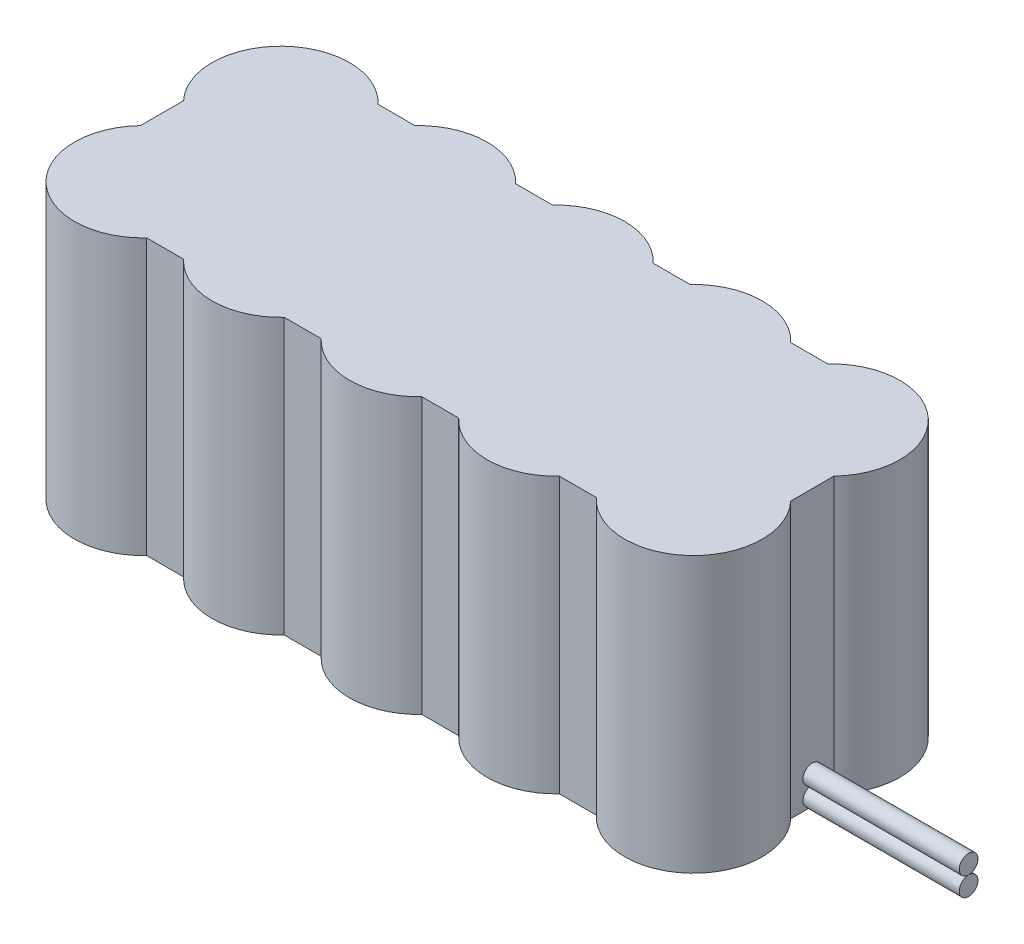
ISO-10303-21;
HEADER;
FILE_DESCRIPTION(('STEP AP214'),'2;1');
FILE_NAME('part.step','',(''),(''),'','','');
FILE_SCHEMA(('AUTOMOTIVE_DESIGN { 1 0 10303 214 1 1 1 1 }'));
ENDSEC;
DATA;
#1=APPLICATION_CONTEXT('core data for automotive mechanical design processes');
#2=APPLICATION_PROTOCOL_DEFINITION('international standard','automotive_design',2000,#1);
#3=PRODUCT_CONTEXT('',#1,'mechanical');
#4=PRODUCT('Part','Part','',(#3));
#5=PRODUCT_RELATED_PRODUCT_CATEGORY('part','',(#4));
#6=PRODUCT_DEFINITION_FORMATION('','',#4);
#7=PRODUCT_DEFINITION_CONTEXT('part definition',#1,'design');
#8=PRODUCT_DEFINITION('design','',#6,#7);
#9=PRODUCT_DEFINITION_SHAPE('','',#8);
#10=(LENGTH_UNIT() NAMED_UNIT(*) SI_UNIT(.MILLI.,.METRE.));
#11=(NAMED_UNIT(*) PLANE_ANGLE_UNIT() SI_UNIT($,.RADIAN.));
#12=(NAMED_UNIT(*) SI_UNIT($,.STERADIAN.) SOLID_ANGLE_UNIT());
#13=UNCERTAINTY_MEASURE_WITH_UNIT(LENGTH_MEASURE(1.E-05),#10,'distance_accuracy_value','');
#14=(GEOMETRIC_REPRESENTATION_CONTEXT(3) GLOBAL_UNCERTAINTY_ASSIGNED_CONTEXT((#13)) GLOBAL_UNIT_ASSIGNED_CONTEXT((#10,
#11,#12)) REPRESENTATION_CONTEXT('',''));
#15=CARTESIAN_POINT('',(0.,0.,0.));
#16=DIRECTION('',(0.,0.,1.));
#17=DIRECTION('',(1.,0.,0.));
#18=AXIS2_PLACEMENT_3D('',#15,#16,#17);
#19=CARTESIAN_POINT('',(96.,4.5,0.));
#20=DIRECTION('',(1.,0.,0.));
#21=DIRECTION('',(0.,0.,-1.));
#22=AXIS2_PLACEMENT_3D('',#19,#20,#21);
#23=CYLINDRICAL_SURFACE('',#22,1.5);
#24=CARTESIAN_POINT('',(121.,4.5,0.));
#25=DIRECTION('',(1.,0.,0.));
#26=DIRECTION('',(0.,0.,-1.));
#27=AXIS2_PLACEMENT_3D('',#24,#25,#26);
#28=CIRCLE('',#27,1.5);
#29=CARTESIAN_POINT('',(121.,4.5,-1.5));
#30=VERTEX_POINT('',#29);
#31=EDGE_CURVE('E109',#30,#30,#28,.F.);
#32=ORIENTED_EDGE('',*,*,#31,.T.);
#33=EDGE_LOOP('',(#32));
#34=FACE_BOUND('',#33,.T.);
#35=CARTESIAN_POINT('',(96.,4.5,0.));
#36=DIRECTION('',(1.,0.,0.));
#37=DIRECTION('',(0.,0.,-1.));
#38=AXIS2_PLACEMENT_3D('',#35,#36,#37);
#39=CIRCLE('',#38,1.5);
#40=CARTESIAN_POINT('',(96.,3.,0.));
#41=VERTEX_POINT('',#40);
#42=EDGE_CURVE('E47',#41,#41,#39,.T.);
#43=ORIENTED_EDGE('',*,*,#42,.T.);
#44=EDGE_LOOP('',(#43));
#45=FACE_BOUND('',#44,.T.);
#46=ADVANCED_FACE('F16',(#34,#45),#23,.T.);
#47=CARTESIAN_POINT('',(121.,0.,0.));
#48=DIRECTION('',(1.,0.,0.));
#49=DIRECTION('',(0.,0.,-1.));
#50=AXIS2_PLACEMENT_3D('',#47,#48,#49);
#51=PLANE('',#50);
#52=ORIENTED_EDGE('',*,*,#31,.F.);
#53=EDGE_LOOP('',(#52));
#54=FACE_BOUND('',#53,.T.);
#55=ADVANCED_FACE('F18',(#54),#51,.T.);
#56=CARTESIAN_POINT('',(96.,1.5,0.));
#57=DIRECTION('',(1.,0.,0.));
#58=DIRECTION('',(0.,0.,-1.));
#59=AXIS2_PLACEMENT_3D('',#56,#57,#58);
#60=CYLINDRICAL_SURFACE('',#59,1.5);
#61=CARTESIAN_POINT('',(121.,1.5,0.));
#62=DIRECTION('',(1.,0.,0.));
#63=DIRECTION('',(0.,0.,-1.));
#64=AXIS2_PLACEMENT_3D('',#61,#62,#63);
#65=CIRCLE('',#64,1.5);
#66=CARTESIAN_POINT('',(121.,1.5,-1.5));
#67=VERTEX_POINT('',#66);
#68=EDGE_CURVE('E106',#67,#67,#65,.F.);
#69=ORIENTED_EDGE('',*,*,#68,.T.);
#70=EDGE_LOOP('',(#69));
#71=FACE_BOUND('',#70,.T.);
#72=CARTESIAN_POINT('',(96.,1.5,0.));
#73=DIRECTION('',(1.,0.,0.));
#74=DIRECTION('',(0.,0.,-1.));
#75=AXIS2_PLACEMENT_3D('',#72,#73,#74);
#76=CIRCLE('',#75,1.5);
#77=CARTESIAN_POINT('',(96.,0.,0.));
#78=VERTEX_POINT('',#77);
#79=EDGE_CURVE('E53',#41,#78,#76,.T.);
#80=ORIENTED_EDGE('',*,*,#79,.T.);
#81=CARTESIAN_POINT('',(96.,1.5,0.));
#82=DIRECTION('',(1.,0.,0.));
#83=DIRECTION('',(0.,0.,-1.));
#84=AXIS2_PLACEMENT_3D('',#81,#82,#83);
#85=CIRCLE('',#84,1.5);
#86=EDGE_CURVE('E57',#78,#41,#85,.T.);
#87=ORIENTED_EDGE('',*,*,#86,.T.);
#88=EDGE_LOOP('',(#80,#87));
#89=FACE_BOUND('',#88,.T.);
#90=ADVANCED_FACE('F55',(#71,#89),#60,.T.);
#91=CARTESIAN_POINT('',(121.,0.,0.));
#92=DIRECTION('',(1.,0.,0.));
#93=DIRECTION('',(0.,0.,-1.));
#94=AXIS2_PLACEMENT_3D('',#91,#92,#93);
#95=PLANE('',#94);
#96=ORIENTED_EDGE('',*,*,#68,.F.);
#97=EDGE_LOOP('',(#96));
#98=FACE_BOUND('',#97,.T.);
#99=ADVANCED_FACE('F120',(#98),#95,.T.);
#100=CARTESIAN_POINT('',(0.,0.,0.));
#101=DIRECTION('',(0.,1.,0.));
#102=DIRECTION('',(0.,0.,1.));
#103=AXIS2_PLACEMENT_3D('',#100,#101,#102);
#104=PLANE('',#103);
#105=DIRECTION('',(1.,0.,0.));
#106=VECTOR('',#105,1.);
#107=CARTESIAN_POINT('',(0.,0.,18.5));
#108=LINE('',#107,#106);
#109=CARTESIAN_POINT('',(74.0467384697155,0.,18.5));
#110=VERTEX_POINT('',#109);
#111=CARTESIAN_POINT('',(79.9532615302845,0.,18.5));
#112=VERTEX_POINT('',#111);
#113=EDGE_CURVE('E108',#110,#112,#108,.T.);
#114=ORIENTED_EDGE('',*,*,#113,.F.);
#115=CARTESIAN_POINT('',(66.,0.,11.));
#116=DIRECTION('',(0.,1.,0.));
#117=DIRECTION('',(0.,0.,1.));
#118=AXIS2_PLACEMENT_3D('',#115,#116,#117);
#119=CIRCLE('',#118,11.);
#120=CARTESIAN_POINT('',(57.9532615302845,0.,18.5));
#121=VERTEX_POINT('',#120);
#122=EDGE_CURVE('E522',#121,#110,#119,.T.);
#123=ORIENTED_EDGE('',*,*,#122,.F.);
#124=DIRECTION('',(1.,0.,0.));
#125=VECTOR('',#124,1.);
#126=CARTESIAN_POINT('',(0.,0.,18.5));
#127=LINE('',#126,#125);
#128=CARTESIAN_POINT('',(52.0467384697155,0.,18.5));
#129=VERTEX_POINT('',#128);
#130=EDGE_CURVE('E393',#129,#121,#127,.T.);
#131=ORIENTED_EDGE('',*,*,#130,.F.);
#132=CARTESIAN_POINT('',(44.,0.,11.));
#133=DIRECTION('',(0.,1.,0.));
#134=DIRECTION('',(0.,0.,1.));
#135=AXIS2_PLACEMENT_3D('',#132,#133,#134);
#136=CIRCLE('',#135,11.);
#137=CARTESIAN_POINT('',(35.9532615302845,0.,18.5));
#138=VERTEX_POINT('',#137);
#139=EDGE_CURVE('E518',#138,#129,#136,.T.);
#140=ORIENTED_EDGE('',*,*,#139,.F.);
#141=DIRECTION('',(1.,0.,0.));
#142=VECTOR('',#141,1.);
#143=CARTESIAN_POINT('',(0.,0.,18.5));
#144=LINE('',#143,#142);
#145=CARTESIAN_POINT('',(30.0467384697155,0.,18.5));
#146=VERTEX_POINT('',#145);
#147=EDGE_CURVE('E515',#146,#138,#144,.T.);
#148=ORIENTED_EDGE('',*,*,#147,.F.);
#149=CARTESIAN_POINT('',(22.,0.,11.));
#150=DIRECTION('',(0.,1.,0.));
#151=DIRECTION('',(0.,0.,1.));
#152=AXIS2_PLACEMENT_3D('',#149,#150,#151);
#153=CIRCLE('',#152,11.);
#154=CARTESIAN_POINT('',(13.9532615302845,0.,18.5));
#155=VERTEX_POINT('',#154);
#156=EDGE_CURVE('E512',#155,#146,#153,.T.);
#157=ORIENTED_EDGE('',*,*,#156,.F.);
#158=DIRECTION('',(1.,0.,0.));
#159=VECTOR('',#158,1.);
#160=CARTESIAN_POINT('',(0.,0.,18.5));
#161=LINE('',#160,#159);
#162=CARTESIAN_POINT('',(8.04673846971554,0.,18.5));
#163=VERTEX_POINT('',#162);
#164=EDGE_CURVE('E509',#163,#155,#161,.T.);
#165=ORIENTED_EDGE('',*,*,#164,.F.);
#166=CARTESIAN_POINT('',(0.,0.,11.));
#167=DIRECTION('',(0.,1.,0.));
#168=DIRECTION('',(0.,0.,1.));
#169=AXIS2_PLACEMENT_3D('',#166,#167,#168);
#170=CIRCLE('',#169,11.);
#171=CARTESIAN_POINT('',(-8.,0.,3.45016556472925));
#172=VERTEX_POINT('',#171);
#173=EDGE_CURVE('E506',#172,#163,#170,.T.);
#174=ORIENTED_EDGE('',*,*,#173,.F.);
#175=DIRECTION('',(0.,0.,1.));
#176=VECTOR('',#175,1.);
#177=CARTESIAN_POINT('',(-8.,0.,0.));
#178=LINE('',#177,#176);
#179=CARTESIAN_POINT('',(-8.,0.,-3.45016556472925));
#180=VERTEX_POINT('',#179);
#181=EDGE_CURVE('E503',#180,#172,#178,.T.);
#182=ORIENTED_EDGE('',*,*,#181,.F.);
#183=CARTESIAN_POINT('',(0.,0.,-11.));
#184=DIRECTION('',(0.,1.,0.));
#185=DIRECTION('',(0.,0.,1.));
#186=AXIS2_PLACEMENT_3D('',#183,#184,#185);
#187=CIRCLE('',#186,11.);
#188=CARTESIAN_POINT('',(8.04673846971554,0.,-18.5));
#189=VERTEX_POINT('',#188);
#190=EDGE_CURVE('E500',#189,#180,#187,.T.);
#191=ORIENTED_EDGE('',*,*,#190,.F.);
#192=DIRECTION('',(1.,0.,0.));
#193=VECTOR('',#192,1.);
#194=CARTESIAN_POINT('',(0.,0.,-18.5));
#195=LINE('',#194,#193);
#196=CARTESIAN_POINT('',(13.9532615302845,0.,-18.5));
#197=VERTEX_POINT('',#196);
#198=EDGE_CURVE('E497',#197,#189,#195,.F.);
#199=ORIENTED_EDGE('',*,*,#198,.F.);
#200=CARTESIAN_POINT('',(22.,0.,-11.));
#201=DIRECTION('',(0.,1.,0.));
#202=DIRECTION('',(0.,0.,1.));
#203=AXIS2_PLACEMENT_3D('',#200,#201,#202);
#204=CIRCLE('',#203,11.);
#205=CARTESIAN_POINT('',(30.0467384697155,0.,-18.5));
#206=VERTEX_POINT('',#205);
#207=EDGE_CURVE('E494',#206,#197,#204,.T.);
#208=ORIENTED_EDGE('',*,*,#207,.F.);
#209=DIRECTION('',(1.,0.,0.));
#210=VECTOR('',#209,1.);
#211=CARTESIAN_POINT('',(0.,0.,-18.5));
#212=LINE('',#211,#210);
#213=CARTESIAN_POINT('',(35.9532615302845,0.,-18.5));
#214=VERTEX_POINT('',#213);
#215=EDGE_CURVE('E491',#214,#206,#212,.F.);
#216=ORIENTED_EDGE('',*,*,#215,.F.);
#217=CARTESIAN_POINT('',(44.,0.,-11.));
#218=DIRECTION('',(0.,1.,0.));
#219=DIRECTION('',(0.,0.,1.));
#220=AXIS2_PLACEMENT_3D('',#217,#218,#219);
#221=CIRCLE('',#220,11.);
#222=CARTESIAN_POINT('',(52.0467384697155,0.,-18.5));
#223=VERTEX_POINT('',#222);
#224=EDGE_CURVE('E488',#223,#214,#221,.T.);
#225=ORIENTED_EDGE('',*,*,#224,.F.);
#226=DIRECTION('',(1.,0.,0.));
#227=VECTOR('',#226,1.);
#228=CARTESIAN_POINT('',(0.,0.,-18.5));
#229=LINE('',#228,#227);
#230=CARTESIAN_POINT('',(57.9532615302845,0.,-18.5));
#231=VERTEX_POINT('',#230);
#232=EDGE_CURVE('E485',#231,#223,#229,.F.);
#233=ORIENTED_EDGE('',*,*,#232,.F.);
#234=CARTESIAN_POINT('',(66.,0.,-11.));
#235=DIRECTION('',(0.,1.,0.));
#236=DIRECTION('',(0.,0.,1.));
#237=AXIS2_PLACEMENT_3D('',#234,#235,#236);
#238=CIRCLE('',#237,11.);
#239=CARTESIAN_POINT('',(74.0467384697155,0.,-18.5));
#240=VERTEX_POINT('',#239);
#241=EDGE_CURVE('E482',#240,#231,#238,.T.);
#242=ORIENTED_EDGE('',*,*,#241,.F.);
#243=DIRECTION('',(1.,0.,0.));
#244=VECTOR('',#243,1.);
#245=CARTESIAN_POINT('',(0.,0.,-18.5));
#246=LINE('',#245,#244);
#247=CARTESIAN_POINT('',(79.9532615302845,0.,-18.5));
#248=VERTEX_POINT('',#247);
#249=EDGE_CURVE('E105',#248,#240,#246,.F.);
#250=ORIENTED_EDGE('',*,*,#249,.F.);
#251=CARTESIAN_POINT('',(88.,0.,-11.));
#252=DIRECTION('',(0.,1.,0.));
#253=DIRECTION('',(0.,0.,1.));
#254=AXIS2_PLACEMENT_3D('',#251,#252,#253);
#255=CIRCLE('',#254,11.);
#256=CARTESIAN_POINT('',(96.,0.,-3.45016539806259));
#257=VERTEX_POINT('',#256);
#258=EDGE_CURVE('E71',#257,#248,#255,.T.);
#259=ORIENTED_EDGE('',*,*,#258,.F.);
#260=DIRECTION('',(0.,0.,-1.));
#261=VECTOR('',#260,1.);
#262=CARTESIAN_POINT('',(96.,0.,0.));
#263=LINE('',#262,#261);
#264=EDGE_CURVE('E65',#78,#257,#263,.T.);
#265=ORIENTED_EDGE('',*,*,#264,.F.);
#266=DIRECTION('',(0.,0.,-1.));
#267=VECTOR('',#266,1.);
#268=CARTESIAN_POINT('',(96.,0.,0.));
#269=LINE('',#268,#267);
#270=CARTESIAN_POINT('',(96.,0.,3.45016556472926));
#271=VERTEX_POINT('',#270);
#272=EDGE_CURVE('E60',#271,#78,#269,.T.);
#273=ORIENTED_EDGE('',*,*,#272,.F.);
#274=CARTESIAN_POINT('',(88.,0.,11.));
#275=DIRECTION('',(0.,1.,0.));
#276=DIRECTION('',(0.,0.,1.));
#277=AXIS2_PLACEMENT_3D('',#274,#275,#276);
#278=CIRCLE('',#277,11.);
#279=EDGE_CURVE('E79',#112,#271,#278,.T.);
#280=ORIENTED_EDGE('',*,*,#279,.F.);
#281=EDGE_LOOP('',(#114,#123,#131,#140,#148,#157,#165,#174,#182,#191,#199,#208,#216,#225,#233,
#242,#250,#259,#265,#273,#280));
#282=FACE_BOUND('',#281,.T.);
#283=ADVANCED_FACE('F67',(#282),#104,.F.);
#284=CARTESIAN_POINT('',(88.,0.,11.));
#285=DIRECTION('',(0.,1.,0.));
#286=DIRECTION('',(0.,0.,1.));
#287=AXIS2_PLACEMENT_3D('',#284,#285,#286);
#288=CYLINDRICAL_SURFACE('',#287,11.);
#289=DIRECTION('',(0.,1.,0.));
#290=VECTOR('',#289,1.);
#291=CARTESIAN_POINT('',(79.9532615302845,0.,18.5));
#292=LINE('',#291,#290);
#293=CARTESIAN_POINT('',(79.9532615302845,44.,18.5));
#294=VERTEX_POINT('',#293);
#295=EDGE_CURVE('E477',#294,#112,#292,.F.);
#296=ORIENTED_EDGE('',*,*,#295,.T.);
#297=ORIENTED_EDGE('',*,*,#279,.T.);
#298=DIRECTION('',(0.,1.,0.));
#299=VECTOR('',#298,1.);
#300=CARTESIAN_POINT('',(96.,22.,3.45016556472926));
#301=LINE('',#300,#299);
#302=CARTESIAN_POINT('',(96.,43.9999998333333,3.45016556472926));
#303=VERTEX_POINT('',#302);
#304=EDGE_CURVE('E20',#271,#303,#301,.T.);
#305=ORIENTED_EDGE('',*,*,#304,.T.);
#306=CARTESIAN_POINT('',(88.,44.,11.));
#307=DIRECTION('',(0.,1.,0.));
#308=DIRECTION('',(0.,0.,1.));
#309=AXIS2_PLACEMENT_3D('',#306,#307,#308);
#310=CIRCLE('',#309,11.);
#311=EDGE_CURVE('E99',#303,#294,#310,.F.);
#312=ORIENTED_EDGE('',*,*,#311,.T.);
#313=EDGE_LOOP('',(#296,#297,#305,#312));
#314=FACE_BOUND('',#313,.T.);
#315=ADVANCED_FACE('F137',(#314),#288,.T.);
#316=CARTESIAN_POINT('',(88.,0.,-11.));
#317=DIRECTION('',(0.,1.,0.));
#318=DIRECTION('',(0.,0.,1.));
#319=AXIS2_PLACEMENT_3D('',#316,#317,#318);
#320=CYLINDRICAL_SURFACE('',#319,11.);
#321=DIRECTION('',(0.,1.,0.));
#322=VECTOR('',#321,1.);
#323=CARTESIAN_POINT('',(96.,22.,-3.45016556472926));
#324=LINE('',#323,#322);
#325=CARTESIAN_POINT('',(96.,43.9999998333333,-3.45016556472926));
#326=VERTEX_POINT('',#325);
#327=EDGE_CURVE('E26',#257,#326,#324,.T.);
#328=ORIENTED_EDGE('',*,*,#327,.F.);
#329=ORIENTED_EDGE('',*,*,#258,.T.);
#330=DIRECTION('',(0.,1.,0.));
#331=VECTOR('',#330,1.);
#332=CARTESIAN_POINT('',(79.9532615302845,0.,-18.5));
#333=LINE('',#332,#331);
#334=CARTESIAN_POINT('',(79.9532615302845,44.,-18.5));
#335=VERTEX_POINT('',#334);
#336=EDGE_CURVE('E91',#335,#248,#333,.F.);
#337=ORIENTED_EDGE('',*,*,#336,.F.);
#338=CARTESIAN_POINT('',(88.,44.,-11.));
#339=DIRECTION('',(0.,1.,0.));
#340=DIRECTION('',(0.,0.,1.));
#341=AXIS2_PLACEMENT_3D('',#338,#339,#340);
#342=CIRCLE('',#341,11.);
#343=EDGE_CURVE('E89',#335,#326,#342,.F.);
#344=ORIENTED_EDGE('',*,*,#343,.T.);
#345=EDGE_LOOP('',(#328,#329,#337,#344));
#346=FACE_BOUND('',#345,.T.);
#347=ADVANCED_FACE('F84',(#346),#320,.T.);
#348=CARTESIAN_POINT('',(0.,44.,0.));
#349=DIRECTION('',(0.,1.,0.));
#350=DIRECTION('',(0.,0.,1.));
#351=AXIS2_PLACEMENT_3D('',#348,#349,#350);
#352=PLANE('',#351);
#353=ORIENTED_EDGE('',*,*,#343,.F.);
#354=DIRECTION('',(-1.,0.,0.));
#355=VECTOR('',#354,1.);
#356=CARTESIAN_POINT('',(96.,44.,-18.5));
#357=LINE('',#356,#355);
#358=CARTESIAN_POINT('',(74.0467384697155,44.,-18.5));
#359=VERTEX_POINT('',#358);
#360=EDGE_CURVE('E95',#359,#335,#357,.F.);
#361=ORIENTED_EDGE('',*,*,#360,.F.);
#362=CARTESIAN_POINT('',(66.,44.,-11.));
#363=DIRECTION('',(0.,1.,0.));
#364=DIRECTION('',(0.,0.,1.));
#365=AXIS2_PLACEMENT_3D('',#362,#363,#364);
#366=CIRCLE('',#365,11.);
#367=CARTESIAN_POINT('',(57.9532615302845,44.,-18.5));
#368=VERTEX_POINT('',#367);
#369=EDGE_CURVE('E97',#368,#359,#366,.F.);
#370=ORIENTED_EDGE('',*,*,#369,.F.);
#371=DIRECTION('',(-1.,0.,0.));
#372=VECTOR('',#371,1.);
#373=CARTESIAN_POINT('',(96.,44.,-18.5));
#374=LINE('',#373,#372);
#375=CARTESIAN_POINT('',(52.0467384697155,44.,-18.5));
#376=VERTEX_POINT('',#375);
#377=EDGE_CURVE('E472',#376,#368,#374,.F.);
#378=ORIENTED_EDGE('',*,*,#377,.F.);
#379=CARTESIAN_POINT('',(44.,44.,-11.));
#380=DIRECTION('',(0.,1.,0.));
#381=DIRECTION('',(0.,0.,1.));
#382=AXIS2_PLACEMENT_3D('',#379,#380,#381);
#383=CIRCLE('',#382,11.);
#384=CARTESIAN_POINT('',(35.9532615302845,44.,-18.5));
#385=VERTEX_POINT('',#384);
#386=EDGE_CURVE('E469',#385,#376,#383,.F.);
#387=ORIENTED_EDGE('',*,*,#386,.F.);
#388=DIRECTION('',(-1.,0.,0.));
#389=VECTOR('',#388,1.);
#390=CARTESIAN_POINT('',(96.,44.,-18.5));
#391=LINE('',#390,#389);
#392=CARTESIAN_POINT('',(30.0467384697155,44.,-18.5));
#393=VERTEX_POINT('',#392);
#394=EDGE_CURVE('E466',#393,#385,#391,.F.);
#395=ORIENTED_EDGE('',*,*,#394,.F.);
#396=CARTESIAN_POINT('',(22.,44.,-11.));
#397=DIRECTION('',(0.,1.,0.));
#398=DIRECTION('',(0.,0.,1.));
#399=AXIS2_PLACEMENT_3D('',#396,#397,#398);
#400=CIRCLE('',#399,11.);
#401=CARTESIAN_POINT('',(13.9532615302845,44.,-18.5));
#402=VERTEX_POINT('',#401);
#403=EDGE_CURVE('E463',#402,#393,#400,.F.);
#404=ORIENTED_EDGE('',*,*,#403,.F.);
#405=DIRECTION('',(-1.,0.,0.));
#406=VECTOR('',#405,1.);
#407=CARTESIAN_POINT('',(96.,44.,-18.5));
#408=LINE('',#407,#406);
#409=CARTESIAN_POINT('',(8.04673846971554,44.,-18.5));
#410=VERTEX_POINT('',#409);
#411=EDGE_CURVE('E460',#410,#402,#408,.F.);
#412=ORIENTED_EDGE('',*,*,#411,.F.);
#413=CARTESIAN_POINT('',(0.,44.,-11.));
#414=DIRECTION('',(0.,1.,0.));
#415=DIRECTION('',(0.,0.,1.));
#416=AXIS2_PLACEMENT_3D('',#413,#414,#415);
#417=CIRCLE('',#416,11.);
#418=CARTESIAN_POINT('',(-8.,44.,-3.45016556472925));
#419=VERTEX_POINT('',#418);
#420=EDGE_CURVE('E457',#419,#410,#417,.F.);
#421=ORIENTED_EDGE('',*,*,#420,.F.);
#422=DIRECTION('',(0.,0.,1.));
#423=VECTOR('',#422,1.);
#424=CARTESIAN_POINT('',(-8.,44.,-18.5));
#425=LINE('',#424,#423);
#426=CARTESIAN_POINT('',(-8.,44.,3.45016556472925));
#427=VERTEX_POINT('',#426);
#428=EDGE_CURVE('E454',#427,#419,#425,.F.);
#429=ORIENTED_EDGE('',*,*,#428,.F.);
#430=CARTESIAN_POINT('',(0.,44.,11.));
#431=DIRECTION('',(0.,1.,0.));
#432=DIRECTION('',(0.,0.,1.));
#433=AXIS2_PLACEMENT_3D('',#430,#431,#432);
#434=CIRCLE('',#433,11.);
#435=CARTESIAN_POINT('',(8.04673846971554,44.,18.5));
#436=VERTEX_POINT('',#435);
#437=EDGE_CURVE('E451',#436,#427,#434,.F.);
#438=ORIENTED_EDGE('',*,*,#437,.F.);
#439=DIRECTION('',(1.,0.,0.));
#440=VECTOR('',#439,1.);
#441=CARTESIAN_POINT('',(-8.,44.,18.5));
#442=LINE('',#441,#440);
#443=CARTESIAN_POINT('',(13.9532615302845,44.,18.5));
#444=VERTEX_POINT('',#443);
#445=EDGE_CURVE('E448',#444,#436,#442,.F.);
#446=ORIENTED_EDGE('',*,*,#445,.F.);
#447=CARTESIAN_POINT('',(22.,44.,11.));
#448=DIRECTION('',(0.,1.,0.));
#449=DIRECTION('',(0.,0.,1.));
#450=AXIS2_PLACEMENT_3D('',#447,#448,#449);
#451=CIRCLE('',#450,11.);
#452=CARTESIAN_POINT('',(30.0467384697155,44.,18.5));
#453=VERTEX_POINT('',#452);
#454=EDGE_CURVE('E445',#453,#444,#451,.F.);
#455=ORIENTED_EDGE('',*,*,#454,.F.);
#456=DIRECTION('',(1.,0.,0.));
#457=VECTOR('',#456,1.);
#458=CARTESIAN_POINT('',(-8.,44.,18.5));
#459=LINE('',#458,#457);
#460=CARTESIAN_POINT('',(35.9532615302845,44.,18.5));
#461=VERTEX_POINT('',#460);
#462=EDGE_CURVE('E442',#461,#453,#459,.F.);
#463=ORIENTED_EDGE('',*,*,#462,.F.);
#464=CARTESIAN_POINT('',(44.,44.,11.));
#465=DIRECTION('',(0.,1.,0.));
#466=DIRECTION('',(0.,0.,1.));
#467=AXIS2_PLACEMENT_3D('',#464,#465,#466);
#468=CIRCLE('',#467,11.);
#469=CARTESIAN_POINT('',(52.0467384697155,44.,18.5));
#470=VERTEX_POINT('',#469);
#471=EDGE_CURVE('E439',#470,#461,#468,.F.);
#472=ORIENTED_EDGE('',*,*,#471,.F.);
#473=DIRECTION('',(1.,0.,0.));
#474=VECTOR('',#473,1.);
#475=CARTESIAN_POINT('',(-8.,44.,18.5));
#476=LINE('',#475,#474);
#477=CARTESIAN_POINT('',(57.9532615302845,44.,18.5));
#478=VERTEX_POINT('',#477);
#479=EDGE_CURVE('E386',#478,#470,#476,.F.);
#480=ORIENTED_EDGE('',*,*,#479,.F.);
#481=CARTESIAN_POINT('',(66.,44.,11.));
#482=DIRECTION('',(0.,1.,0.));
#483=DIRECTION('',(0.,0.,1.));
#484=AXIS2_PLACEMENT_3D('',#481,#482,#483);
#485=CIRCLE('',#484,11.);
#486=CARTESIAN_POINT('',(74.0467384697155,44.,18.5));
#487=VERTEX_POINT('',#486);
#488=EDGE_CURVE('E373',#487,#478,#485,.F.);
#489=ORIENTED_EDGE('',*,*,#488,.F.);
#490=DIRECTION('',(1.,0.,0.));
#491=VECTOR('',#490,1.);
#492=CARTESIAN_POINT('',(-8.,44.,18.5));
#493=LINE('',#492,#491);
#494=EDGE_CURVE('E385',#294,#487,#493,.F.);
#495=ORIENTED_EDGE('',*,*,#494,.F.);
#496=ORIENTED_EDGE('',*,*,#311,.F.);
#497=DIRECTION('',(0.,0.,-1.));
#498=VECTOR('',#497,1.);
#499=CARTESIAN_POINT('',(96.,44.,0.));
#500=LINE('',#499,#498);
#501=EDGE_CURVE('E10',#303,#326,#500,.T.);
#502=ORIENTED_EDGE('',*,*,#501,.T.);
#503=EDGE_LOOP('',(#353,#361,#370,#378,#387,#395,#404,#412,#421,#429,#438,#446,#455,#463,#472,
#480,#489,#495,#496,#502));
#504=FACE_BOUND('',#503,.T.);
#505=ADVANCED_FACE('F142',(#504),#352,.T.);
#506=CARTESIAN_POINT('',(96.,0.,-18.5));
#507=DIRECTION('',(0.,0.,-1.));
#508=DIRECTION('',(-1.,0.,0.));
#509=AXIS2_PLACEMENT_3D('',#506,#507,#508);
#510=PLANE('',#509);
#511=ORIENTED_EDGE('',*,*,#360,.T.);
#512=ORIENTED_EDGE('',*,*,#336,.T.);
#513=ORIENTED_EDGE('',*,*,#249,.T.);
#514=DIRECTION('',(0.,1.,0.));
#515=VECTOR('',#514,1.);
#516=CARTESIAN_POINT('',(74.0467384697155,0.,-18.5));
#517=LINE('',#516,#515);
#518=EDGE_CURVE('E434',#359,#240,#517,.F.);
#519=ORIENTED_EDGE('',*,*,#518,.F.);
#520=EDGE_LOOP('',(#511,#512,#513,#519));
#521=FACE_BOUND('',#520,.T.);
#522=ADVANCED_FACE('F145',(#521),#510,.T.);
#523=CARTESIAN_POINT('',(66.,0.,-11.));
#524=DIRECTION('',(0.,1.,0.));
#525=DIRECTION('',(0.,0.,1.));
#526=AXIS2_PLACEMENT_3D('',#523,#524,#525);
#527=CYLINDRICAL_SURFACE('',#526,11.);
#528=ORIENTED_EDGE('',*,*,#369,.T.);
#529=ORIENTED_EDGE('',*,*,#518,.T.);
#530=ORIENTED_EDGE('',*,*,#241,.T.);
#531=DIRECTION('',(0.,1.,0.));
#532=VECTOR('',#531,1.);
#533=CARTESIAN_POINT('',(57.9532615302845,0.,-18.5));
#534=LINE('',#533,#532);
#535=EDGE_CURVE('E431',#368,#231,#534,.F.);
#536=ORIENTED_EDGE('',*,*,#535,.F.);
#537=EDGE_LOOP('',(#528,#529,#530,#536));
#538=FACE_BOUND('',#537,.T.);
#539=ADVANCED_FACE('F148',(#538),#527,.T.);
#540=CARTESIAN_POINT('',(96.,0.,-18.5));
#541=DIRECTION('',(0.,0.,-1.));
#542=DIRECTION('',(-1.,0.,0.));
#543=AXIS2_PLACEMENT_3D('',#540,#541,#542);
#544=PLANE('',#543);
#545=ORIENTED_EDGE('',*,*,#377,.T.);
#546=ORIENTED_EDGE('',*,*,#535,.T.);
#547=ORIENTED_EDGE('',*,*,#232,.T.);
#548=DIRECTION('',(0.,1.,0.));
#549=VECTOR('',#548,1.);
#550=CARTESIAN_POINT('',(52.0467384697155,0.,-18.5));
#551=LINE('',#550,#549);
#552=EDGE_CURVE('E428',#376,#223,#551,.F.);
#553=ORIENTED_EDGE('',*,*,#552,.F.);
#554=EDGE_LOOP('',(#545,#546,#547,#553));
#555=FACE_BOUND('',#554,.T.);
#556=ADVANCED_FACE('F152',(#555),#544,.T.);
#557=CARTESIAN_POINT('',(44.,0.,-11.));
#558=DIRECTION('',(0.,1.,0.));
#559=DIRECTION('',(0.,0.,1.));
#560=AXIS2_PLACEMENT_3D('',#557,#558,#559);
#561=CYLINDRICAL_SURFACE('',#560,11.);
#562=ORIENTED_EDGE('',*,*,#386,.T.);
#563=ORIENTED_EDGE('',*,*,#552,.T.);
#564=ORIENTED_EDGE('',*,*,#224,.T.);
#565=DIRECTION('',(0.,1.,0.));
#566=VECTOR('',#565,1.);
#567=CARTESIAN_POINT('',(35.9532615302845,0.,-18.5));
#568=LINE('',#567,#566);
#569=EDGE_CURVE('E425',#385,#214,#568,.F.);
#570=ORIENTED_EDGE('',*,*,#569,.F.);
#571=EDGE_LOOP('',(#562,#563,#564,#570));
#572=FACE_BOUND('',#571,.T.);
#573=ADVANCED_FACE('F156',(#572),#561,.T.);
#574=CARTESIAN_POINT('',(96.,0.,-18.5));
#575=DIRECTION('',(0.,0.,-1.));
#576=DIRECTION('',(-1.,0.,0.));
#577=AXIS2_PLACEMENT_3D('',#574,#575,#576);
#578=PLANE('',#577);
#579=ORIENTED_EDGE('',*,*,#394,.T.);
#580=ORIENTED_EDGE('',*,*,#569,.T.);
#581=ORIENTED_EDGE('',*,*,#215,.T.);
#582=DIRECTION('',(0.,1.,0.));
#583=VECTOR('',#582,1.);
#584=CARTESIAN_POINT('',(30.0467384697155,0.,-18.5));
#585=LINE('',#584,#583);
#586=EDGE_CURVE('E422',#393,#206,#585,.F.);
#587=ORIENTED_EDGE('',*,*,#586,.F.);
#588=EDGE_LOOP('',(#579,#580,#581,#587));
#589=FACE_BOUND('',#588,.T.);
#590=ADVANCED_FACE('F160',(#589),#578,.T.);
#591=CARTESIAN_POINT('',(22.,0.,-11.));
#592=DIRECTION('',(0.,1.,0.));
#593=DIRECTION('',(0.,0.,1.));
#594=AXIS2_PLACEMENT_3D('',#591,#592,#593);
#595=CYLINDRICAL_SURFACE('',#594,11.);
#596=ORIENTED_EDGE('',*,*,#403,.T.);
#597=ORIENTED_EDGE('',*,*,#586,.T.);
#598=ORIENTED_EDGE('',*,*,#207,.T.);
#599=DIRECTION('',(0.,1.,0.));
#600=VECTOR('',#599,1.);
#601=CARTESIAN_POINT('',(13.9532615302845,0.,-18.5));
#602=LINE('',#601,#600);
#603=EDGE_CURVE('E419',#402,#197,#602,.F.);
#604=ORIENTED_EDGE('',*,*,#603,.F.);
#605=EDGE_LOOP('',(#596,#597,#598,#604));
#606=FACE_BOUND('',#605,.T.);
#607=ADVANCED_FACE('F164',(#606),#595,.T.);
#608=CARTESIAN_POINT('',(96.,0.,-18.5));
#609=DIRECTION('',(0.,0.,-1.));
#610=DIRECTION('',(-1.,0.,0.));
#611=AXIS2_PLACEMENT_3D('',#608,#609,#610);
#612=PLANE('',#611);
#613=ORIENTED_EDGE('',*,*,#411,.T.);
#614=ORIENTED_EDGE('',*,*,#603,.T.);
#615=ORIENTED_EDGE('',*,*,#198,.T.);
#616=DIRECTION('',(0.,1.,0.));
#617=VECTOR('',#616,1.);
#618=CARTESIAN_POINT('',(8.04673846971554,0.,-18.5));
#619=LINE('',#618,#617);
#620=EDGE_CURVE('E416',#410,#189,#619,.F.);
#621=ORIENTED_EDGE('',*,*,#620,.F.);
#622=EDGE_LOOP('',(#613,#614,#615,#621));
#623=FACE_BOUND('',#622,.T.);
#624=ADVANCED_FACE('F168',(#623),#612,.T.);
#625=CARTESIAN_POINT('',(0.,0.,-11.));
#626=DIRECTION('',(0.,1.,0.));
#627=DIRECTION('',(0.,0.,1.));
#628=AXIS2_PLACEMENT_3D('',#625,#626,#627);
#629=CYLINDRICAL_SURFACE('',#628,11.);
#630=DIRECTION('',(0.,1.,0.));
#631=VECTOR('',#630,1.);
#632=CARTESIAN_POINT('',(-8.,0.,-3.45016556472925));
#633=LINE('',#632,#631);
#634=EDGE_CURVE('E413',#419,#180,#633,.F.);
#635=ORIENTED_EDGE('',*,*,#634,.F.);
#636=ORIENTED_EDGE('',*,*,#420,.T.);
#637=ORIENTED_EDGE('',*,*,#620,.T.);
#638=ORIENTED_EDGE('',*,*,#190,.T.);
#639=EDGE_LOOP('',(#635,#636,#637,#638));
#640=FACE_BOUND('',#639,.T.);
#641=ADVANCED_FACE('F172',(#640),#629,.T.);
#642=CARTESIAN_POINT('',(-8.,0.,-18.5));
#643=DIRECTION('',(-1.,0.,0.));
#644=DIRECTION('',(0.,0.,1.));
#645=AXIS2_PLACEMENT_3D('',#642,#643,#644);
#646=PLANE('',#645);
#647=ORIENTED_EDGE('',*,*,#428,.T.);
#648=ORIENTED_EDGE('',*,*,#634,.T.);
#649=ORIENTED_EDGE('',*,*,#181,.T.);
#650=DIRECTION('',(0.,1.,0.));
#651=VECTOR('',#650,1.);
#652=CARTESIAN_POINT('',(-8.,0.,3.45016556472925));
#653=LINE('',#652,#651);
#654=EDGE_CURVE('E410',#427,#172,#653,.F.);
#655=ORIENTED_EDGE('',*,*,#654,.F.);
#656=EDGE_LOOP('',(#647,#648,#649,#655));
#657=FACE_BOUND('',#656,.T.);
#658=ADVANCED_FACE('F176',(#657),#646,.T.);
#659=CARTESIAN_POINT('',(0.,0.,11.));
#660=DIRECTION('',(0.,1.,0.));
#661=DIRECTION('',(0.,0.,1.));
#662=AXIS2_PLACEMENT_3D('',#659,#660,#661);
#663=CYLINDRICAL_SURFACE('',#662,11.);
#664=DIRECTION('',(0.,1.,0.));
#665=VECTOR('',#664,1.);
#666=CARTESIAN_POINT('',(8.04673846971554,0.,18.5));
#667=LINE('',#666,#665);
#668=EDGE_CURVE('E407',#436,#163,#667,.F.);
#669=ORIENTED_EDGE('',*,*,#668,.F.);
#670=ORIENTED_EDGE('',*,*,#437,.T.);
#671=ORIENTED_EDGE('',*,*,#654,.T.);
#672=ORIENTED_EDGE('',*,*,#173,.T.);
#673=EDGE_LOOP('',(#669,#670,#671,#672));
#674=FACE_BOUND('',#673,.T.);
#675=ADVANCED_FACE('F180',(#674),#663,.T.);
#676=CARTESIAN_POINT('',(-8.,0.,18.5));
#677=DIRECTION('',(0.,0.,1.));
#678=DIRECTION('',(1.,0.,0.));
#679=AXIS2_PLACEMENT_3D('',#676,#677,#678);
#680=PLANE('',#679);
#681=ORIENTED_EDGE('',*,*,#164,.T.);
#682=DIRECTION('',(0.,1.,0.));
#683=VECTOR('',#682,1.);
#684=CARTESIAN_POINT('',(13.9532615302845,0.,18.5));
#685=LINE('',#684,#683);
#686=EDGE_CURVE('E404',#444,#155,#685,.F.);
#687=ORIENTED_EDGE('',*,*,#686,.F.);
#688=ORIENTED_EDGE('',*,*,#445,.T.);
#689=ORIENTED_EDGE('',*,*,#668,.T.);
#690=EDGE_LOOP('',(#681,#687,#688,#689));
#691=FACE_BOUND('',#690,.T.);
#692=ADVANCED_FACE('F184',(#691),#680,.T.);
#693=CARTESIAN_POINT('',(22.,0.,11.));
#694=DIRECTION('',(0.,1.,0.));
#695=DIRECTION('',(0.,0.,1.));
#696=AXIS2_PLACEMENT_3D('',#693,#694,#695);
#697=CYLINDRICAL_SURFACE('',#696,11.);
#698=ORIENTED_EDGE('',*,*,#454,.T.);
#699=ORIENTED_EDGE('',*,*,#686,.T.);
#700=ORIENTED_EDGE('',*,*,#156,.T.);
#701=DIRECTION('',(0.,1.,0.));
#702=VECTOR('',#701,1.);
#703=CARTESIAN_POINT('',(30.0467384697155,0.,18.5));
#704=LINE('',#703,#702);
#705=EDGE_CURVE('E401',#453,#146,#704,.F.);
#706=ORIENTED_EDGE('',*,*,#705,.F.);
#707=EDGE_LOOP('',(#698,#699,#700,#706));
#708=FACE_BOUND('',#707,.T.);
#709=ADVANCED_FACE('F188',(#708),#697,.T.);
#710=CARTESIAN_POINT('',(-8.,0.,18.5));
#711=DIRECTION('',(0.,0.,1.));
#712=DIRECTION('',(1.,0.,0.));
#713=AXIS2_PLACEMENT_3D('',#710,#711,#712);
#714=PLANE('',#713);
#715=ORIENTED_EDGE('',*,*,#147,.T.);
#716=DIRECTION('',(0.,1.,0.));
#717=VECTOR('',#716,1.);
#718=CARTESIAN_POINT('',(35.9532615302845,0.,18.5));
#719=LINE('',#718,#717);
#720=EDGE_CURVE('E396',#461,#138,#719,.F.);
#721=ORIENTED_EDGE('',*,*,#720,.F.);
#722=ORIENTED_EDGE('',*,*,#462,.T.);
#723=ORIENTED_EDGE('',*,*,#705,.T.);
#724=EDGE_LOOP('',(#715,#721,#722,#723));
#725=FACE_BOUND('',#724,.T.);
#726=ADVANCED_FACE('F192',(#725),#714,.T.);
#727=CARTESIAN_POINT('',(44.,0.,11.));
#728=DIRECTION('',(0.,1.,0.));
#729=DIRECTION('',(0.,0.,1.));
#730=AXIS2_PLACEMENT_3D('',#727,#728,#729);
#731=CYLINDRICAL_SURFACE('',#730,11.);
#732=ORIENTED_EDGE('',*,*,#471,.T.);
#733=ORIENTED_EDGE('',*,*,#720,.T.);
#734=ORIENTED_EDGE('',*,*,#139,.T.);
#735=DIRECTION('',(0.,1.,0.));
#736=VECTOR('',#735,1.);
#737=CARTESIAN_POINT('',(52.0467384697155,0.,18.5));
#738=LINE('',#737,#736);
#739=EDGE_CURVE('E394',#470,#129,#738,.F.);
#740=ORIENTED_EDGE('',*,*,#739,.F.);
#741=EDGE_LOOP('',(#732,#733,#734,#740));
#742=FACE_BOUND('',#741,.T.);
#743=ADVANCED_FACE('F196',(#742),#731,.T.);
#744=CARTESIAN_POINT('',(-8.,0.,18.5));
#745=DIRECTION('',(0.,0.,1.));
#746=DIRECTION('',(1.,0.,0.));
#747=AXIS2_PLACEMENT_3D('',#744,#745,#746);
#748=PLANE('',#747);
#749=ORIENTED_EDGE('',*,*,#130,.T.);
#750=DIRECTION('',(0.,1.,0.));
#751=VECTOR('',#750,1.);
#752=CARTESIAN_POINT('',(57.9532615302845,0.,18.5));
#753=LINE('',#752,#751);
#754=EDGE_CURVE('E377',#478,#121,#753,.F.);
#755=ORIENTED_EDGE('',*,*,#754,.F.);
#756=ORIENTED_EDGE('',*,*,#479,.T.);
#757=ORIENTED_EDGE('',*,*,#739,.T.);
#758=EDGE_LOOP('',(#749,#755,#756,#757));
#759=FACE_BOUND('',#758,.T.);
#760=ADVANCED_FACE('F200',(#759),#748,.T.);
#761=CARTESIAN_POINT('',(66.,0.,11.));
#762=DIRECTION('',(0.,1.,0.));
#763=DIRECTION('',(0.,0.,1.));
#764=AXIS2_PLACEMENT_3D('',#761,#762,#763);
#765=CYLINDRICAL_SURFACE('',#764,11.);
#766=ORIENTED_EDGE('',*,*,#488,.T.);
#767=ORIENTED_EDGE('',*,*,#754,.T.);
#768=ORIENTED_EDGE('',*,*,#122,.T.);
#769=DIRECTION('',(0.,1.,0.));
#770=VECTOR('',#769,1.);
#771=CARTESIAN_POINT('',(74.0467384697155,0.,18.5));
#772=LINE('',#771,#770);
#773=EDGE_CURVE('E379',#487,#110,#772,.F.);
#774=ORIENTED_EDGE('',*,*,#773,.F.);
#775=EDGE_LOOP('',(#766,#767,#768,#774));
#776=FACE_BOUND('',#775,.T.);
#777=ADVANCED_FACE('F131',(#776),#765,.T.);
#778=CARTESIAN_POINT('',(-8.,0.,18.5));
#779=DIRECTION('',(0.,0.,1.));
#780=DIRECTION('',(1.,0.,0.));
#781=AXIS2_PLACEMENT_3D('',#778,#779,#780);
#782=PLANE('',#781);
#783=ORIENTED_EDGE('',*,*,#113,.T.);
#784=ORIENTED_EDGE('',*,*,#295,.F.);
#785=ORIENTED_EDGE('',*,*,#494,.T.);
#786=ORIENTED_EDGE('',*,*,#773,.T.);
#787=EDGE_LOOP('',(#783,#784,#785,#786));
#788=FACE_BOUND('',#787,.T.);
#789=ADVANCED_FACE('F124',(#788),#782,.T.);
#790=CARTESIAN_POINT('',(96.,0.,18.5));
#791=DIRECTION('',(1.,0.,0.));
#792=DIRECTION('',(0.,0.,-1.));
#793=AXIS2_PLACEMENT_3D('',#790,#791,#792);
#794=PLANE('',#793);
#795=ORIENTED_EDGE('',*,*,#304,.F.);
#796=ORIENTED_EDGE('',*,*,#272,.T.);
#797=ORIENTED_EDGE('',*,*,#79,.F.);
#798=ORIENTED_EDGE('',*,*,#42,.F.);
#799=ORIENTED_EDGE('',*,*,#86,.F.);
#800=ORIENTED_EDGE('',*,*,#264,.T.);
#801=ORIENTED_EDGE('',*,*,#327,.T.);
#802=ORIENTED_EDGE('',*,*,#501,.F.);
#803=EDGE_LOOP('',(#795,#796,#797,#798,#799,#800,#801,#802));
#804=FACE_BOUND('',#803,.T.);
#805=ADVANCED_FACE('F74',(#804),#794,.T.);
#806=CLOSED_SHELL('',(#46,#55,#90,#99,#283,#315,#347,#505,#522,#539,#556,#573,#590,#607,#624,
#641,#658,#675,#692,#709,#726,#743,#760,#777,#789,#805));
#807=MANIFOLD_SOLID_BREP('B1',#806);
#808=ADVANCED_BREP_SHAPE_REPRESENTATION('',(#18,#807),#14);
#809=SHAPE_DEFINITION_REPRESENTATION(#9,#808);
ENDSEC;
END-ISO-10303-21;
